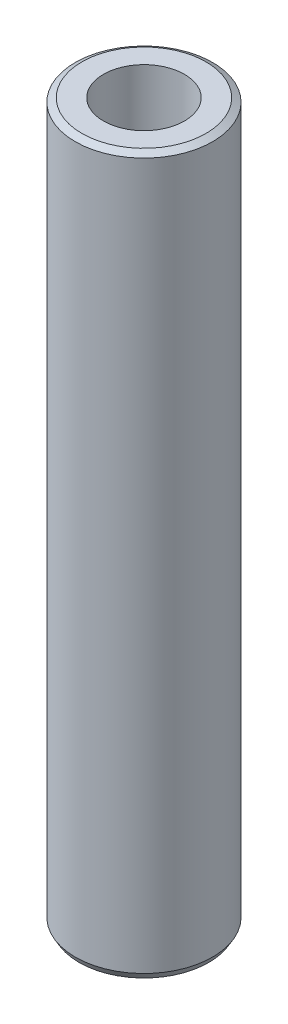
ISO-10303-21;
HEADER;
FILE_DESCRIPTION(('STEP AP214'),'2;1');
FILE_NAME('part.step','',(''),(''),'','','');
FILE_SCHEMA(('AUTOMOTIVE_DESIGN { 1 0 10303 214 1 1 1 1 }'));
ENDSEC;
DATA;
#1=APPLICATION_CONTEXT('core data for automotive mechanical design processes');
#2=APPLICATION_PROTOCOL_DEFINITION('international standard','automotive_design',2000,#1);
#3=PRODUCT_CONTEXT('',#1,'mechanical');
#4=PRODUCT('Part','Part','',(#3));
#5=PRODUCT_RELATED_PRODUCT_CATEGORY('part','',(#4));
#6=PRODUCT_DEFINITION_FORMATION('','',#4);
#7=PRODUCT_DEFINITION_CONTEXT('part definition',#1,'design');
#8=PRODUCT_DEFINITION('design','',#6,#7);
#9=PRODUCT_DEFINITION_SHAPE('','',#8);
#10=(LENGTH_UNIT() NAMED_UNIT(*) SI_UNIT(.MILLI.,.METRE.));
#11=(NAMED_UNIT(*) PLANE_ANGLE_UNIT() SI_UNIT($,.RADIAN.));
#12=(NAMED_UNIT(*) SI_UNIT($,.STERADIAN.) SOLID_ANGLE_UNIT());
#13=UNCERTAINTY_MEASURE_WITH_UNIT(LENGTH_MEASURE(1.E-05),#10,'distance_accuracy_value','');
#14=(GEOMETRIC_REPRESENTATION_CONTEXT(3) GLOBAL_UNCERTAINTY_ASSIGNED_CONTEXT((#13)) GLOBAL_UNIT_ASSIGNED_CONTEXT((#10,
#11,#12)) REPRESENTATION_CONTEXT('',''));
#15=CARTESIAN_POINT('',(0.,0.,0.));
#16=DIRECTION('',(0.,0.,1.));
#17=DIRECTION('',(1.,0.,0.));
#18=AXIS2_PLACEMENT_3D('',#15,#16,#17);
#19=CARTESIAN_POINT('',(0.,600.,0.));
#20=DIRECTION('',(0.,-1.,0.));
#21=DIRECTION('',(0.,0.,-1.));
#22=AXIS2_PLACEMENT_3D('',#19,#20,#21);
#23=CYLINDRICAL_SURFACE('',#22,57.5);
#24=CARTESIAN_POINT('',(0.,596.799909900111,0.));
#25=DIRECTION('',(0.,1.,0.));
#26=DIRECTION('',(0.,0.,1.));
#27=AXIS2_PLACEMENT_3D('',#24,#25,#26);
#28=CIRCLE('',#27,57.5);
#29=CARTESIAN_POINT('',(0.,596.799909900111,57.5));
#30=VERTEX_POINT('',#29);
#31=EDGE_CURVE('E50',#30,#30,#28,.F.);
#32=ORIENTED_EDGE('',*,*,#31,.T.);
#33=EDGE_LOOP('',(#32));
#34=FACE_BOUND('',#33,.T.);
#35=CARTESIAN_POINT('',(0.,5.54271864180511,0.));
#36=DIRECTION('',(0.,1.,0.));
#37=DIRECTION('',(0.,0.,1.));
#38=AXIS2_PLACEMENT_3D('',#35,#36,#37);
#39=CIRCLE('',#38,57.5);
#40=CARTESIAN_POINT('',(0.,5.54271864180511,57.5));
#41=VERTEX_POINT('',#40);
#42=EDGE_CURVE('E51',#41,#41,#39,.T.);
#43=ORIENTED_EDGE('',*,*,#42,.T.);
#44=EDGE_LOOP('',(#43));
#45=FACE_BOUND('',#44,.T.);
#46=ADVANCED_FACE('F39',(#34,#45),#23,.T.);
#47=CARTESIAN_POINT('',(0.,600.,0.));
#48=DIRECTION('',(0.,1.,0.));
#49=DIRECTION('',(0.,0.,1.));
#50=AXIS2_PLACEMENT_3D('',#47,#48,#49);
#51=PLANE('',#50);
#52=CARTESIAN_POINT('',(0.,600.,0.));
#53=DIRECTION('',(0.,1.,0.));
#54=DIRECTION('',(0.,0.,1.));
#55=AXIS2_PLACEMENT_3D('',#52,#53,#54);
#56=CIRCLE('',#55,51.9572813581949);
#57=CARTESIAN_POINT('',(0.,600.,51.9572813581949));
#58=VERTEX_POINT('',#57);
#59=EDGE_CURVE('E54',#58,#58,#56,.T.);
#60=ORIENTED_EDGE('',*,*,#59,.T.);
#61=EDGE_LOOP('',(#60));
#62=FACE_BOUND('',#61,.T.);
#63=CARTESIAN_POINT('',(0.,600.,0.));
#64=DIRECTION('',(0.,1.,0.));
#65=DIRECTION('',(0.,0.,1.));
#66=AXIS2_PLACEMENT_3D('',#63,#64,#65);
#67=CIRCLE('',#66,33.9092324647109);
#68=CARTESIAN_POINT('',(0.,600.,33.9092324647109));
#69=VERTEX_POINT('',#68);
#70=EDGE_CURVE('E58',#69,#69,#67,.T.);
#71=ORIENTED_EDGE('',*,*,#70,.F.);
#72=EDGE_LOOP('',(#71));
#73=FACE_BOUND('',#72,.T.);
#74=ADVANCED_FACE('F69',(#62,#73),#51,.T.);
#75=CARTESIAN_POINT('',(0.,0.,0.));
#76=DIRECTION('',(0.,1.,0.));
#77=DIRECTION('',(0.,0.,1.));
#78=AXIS2_PLACEMENT_3D('',#75,#76,#77);
#79=PLANE('',#78);
#80=CARTESIAN_POINT('',(0.,0.,0.));
#81=DIRECTION('',(0.,1.,0.));
#82=DIRECTION('',(0.,0.,1.));
#83=AXIS2_PLACEMENT_3D('',#80,#81,#82);
#84=CIRCLE('',#83,54.2999099001115);
#85=CARTESIAN_POINT('',(0.,0.,54.2999099001115));
#86=VERTEX_POINT('',#85);
#87=EDGE_CURVE('E10',#86,#86,#84,.F.);
#88=ORIENTED_EDGE('',*,*,#87,.T.);
#89=EDGE_LOOP('',(#88));
#90=FACE_BOUND('',#89,.T.);
#91=CARTESIAN_POINT('',(0.,0.,0.));
#92=DIRECTION('',(0.,1.,0.));
#93=DIRECTION('',(0.,0.,1.));
#94=AXIS2_PLACEMENT_3D('',#91,#92,#93);
#95=CIRCLE('',#94,33.9092324647109);
#96=CARTESIAN_POINT('',(0.,0.,33.9092324647109));
#97=VERTEX_POINT('',#96);
#98=EDGE_CURVE('E63',#97,#97,#95,.T.);
#99=ORIENTED_EDGE('',*,*,#98,.T.);
#100=EDGE_LOOP('',(#99));
#101=FACE_BOUND('',#100,.T.);
#102=ADVANCED_FACE('F75',(#90,#101),#79,.F.);
#103=CARTESIAN_POINT('',(0.,600.,0.));
#104=DIRECTION('',(0.,-1.,0.));
#105=DIRECTION('',(0.,0.,-1.));
#106=AXIS2_PLACEMENT_3D('',#103,#104,#105);
#107=CYLINDRICAL_SURFACE('',#106,33.9092324647109);
#108=ORIENTED_EDGE('',*,*,#70,.T.);
#109=EDGE_LOOP('',(#108));
#110=FACE_BOUND('',#109,.T.);
#111=ORIENTED_EDGE('',*,*,#98,.F.);
#112=EDGE_LOOP('',(#111));
#113=FACE_BOUND('',#112,.T.);
#114=ADVANCED_FACE('F70',(#110,#113),#107,.F.);
#115=CARTESIAN_POINT('',(0.,600.,0.));
#116=DIRECTION('',(0.,-1.,0.));
#117=DIRECTION('',(0.,0.,-1.));
#118=AXIS2_PLACEMENT_3D('',#115,#116,#117);
#119=CONICAL_SURFACE('',#118,51.9572813581949,1.0471975511966);
#120=ORIENTED_EDGE('',*,*,#31,.F.);
#121=EDGE_LOOP('',(#120));
#122=FACE_BOUND('',#121,.T.);
#123=ORIENTED_EDGE('',*,*,#59,.F.);
#124=EDGE_LOOP('',(#123));
#125=FACE_BOUND('',#124,.T.);
#126=ADVANCED_FACE('F81',(#122,#125),#119,.T.);
#127=CARTESIAN_POINT('',(0.,5.54271864180511,0.));
#128=DIRECTION('',(0.,1.,0.));
#129=DIRECTION('',(0.,0.,1.));
#130=AXIS2_PLACEMENT_3D('',#127,#128,#129);
#131=CONICAL_SURFACE('',#130,57.5,0.523598775598299);
#132=ORIENTED_EDGE('',*,*,#87,.F.);
#133=EDGE_LOOP('',(#132));
#134=FACE_BOUND('',#133,.T.);
#135=ORIENTED_EDGE('',*,*,#42,.F.);
#136=EDGE_LOOP('',(#135));
#137=FACE_BOUND('',#136,.T.);
#138=ADVANCED_FACE('F45',(#134,#137),#131,.T.);
#139=CLOSED_SHELL('',(#46,#74,#102,#114,#126,#138));
#140=MANIFOLD_SOLID_BREP('B2',#139);
#141=ADVANCED_BREP_SHAPE_REPRESENTATION('',(#18,#140),#14);
#142=SHAPE_DEFINITION_REPRESENTATION(#9,#141);
ENDSEC;
END-ISO-10303-21;
